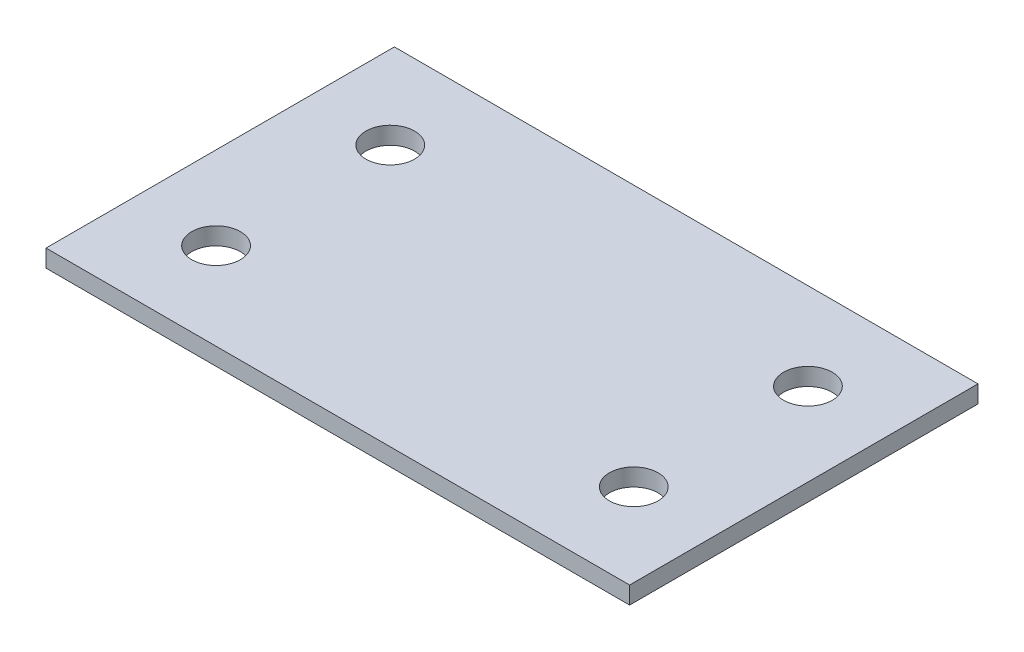
ISO-10303-21;
HEADER;
FILE_DESCRIPTION(('STEP AP214'),'2;1');
FILE_NAME('part.step','',(''),(''),'','','');
FILE_SCHEMA(('AUTOMOTIVE_DESIGN { 1 0 10303 214 1 1 1 1 }'));
ENDSEC;
DATA;
#1=APPLICATION_CONTEXT('core data for automotive mechanical design processes');
#2=APPLICATION_PROTOCOL_DEFINITION('international standard','automotive_design',2000,#1);
#3=PRODUCT_CONTEXT('',#1,'mechanical');
#4=PRODUCT('Part','Part','',(#3));
#5=PRODUCT_RELATED_PRODUCT_CATEGORY('part','',(#4));
#6=PRODUCT_DEFINITION_FORMATION('','',#4);
#7=PRODUCT_DEFINITION_CONTEXT('part definition',#1,'design');
#8=PRODUCT_DEFINITION('design','',#6,#7);
#9=PRODUCT_DEFINITION_SHAPE('','',#8);
#10=(LENGTH_UNIT() NAMED_UNIT(*) SI_UNIT(.MILLI.,.METRE.));
#11=(NAMED_UNIT(*) PLANE_ANGLE_UNIT() SI_UNIT($,.RADIAN.));
#12=(NAMED_UNIT(*) SI_UNIT($,.STERADIAN.) SOLID_ANGLE_UNIT());
#13=UNCERTAINTY_MEASURE_WITH_UNIT(LENGTH_MEASURE(1.E-05),#10,'distance_accuracy_value','');
#14=(GEOMETRIC_REPRESENTATION_CONTEXT(3) GLOBAL_UNCERTAINTY_ASSIGNED_CONTEXT((#13)) GLOBAL_UNIT_ASSIGNED_CONTEXT((#10,
#11,#12)) REPRESENTATION_CONTEXT('',''));
#15=CARTESIAN_POINT('',(0.,0.,0.));
#16=DIRECTION('',(0.,0.,1.));
#17=DIRECTION('',(1.,0.,0.));
#18=AXIS2_PLACEMENT_3D('',#15,#16,#17);
#19=CARTESIAN_POINT('',(2.596030114,0.,20.));
#20=DIRECTION('',(0.,1.,0.));
#21=DIRECTION('',(-1.,0.,0.));
#22=AXIS2_PLACEMENT_3D('',#19,#20,#21);
#23=PLANE('',#22);
#24=CARTESIAN_POINT('',(26.5751877305636,0.,4.999999967));
#25=DIRECTION('',(0.,1.,0.));
#26=DIRECTION('',(-1.,0.,0.));
#27=AXIS2_PLACEMENT_3D('',#24,#25,#26);
#28=CIRCLE('',#27,1.397);
#29=CARTESIAN_POINT('',(25.1781877305636,0.,4.999999967));
#30=VERTEX_POINT('',#29);
#31=EDGE_CURVE('E115',#30,#30,#28,.F.);
#32=ORIENTED_EDGE('',*,*,#31,.F.);
#33=EDGE_LOOP('',(#32));
#34=FACE_BOUND('',#33,.T.);
#35=CARTESIAN_POINT('',(2.596030114,0.,4.999999967));
#36=DIRECTION('',(0.,1.,0.));
#37=DIRECTION('',(-1.,0.,0.));
#38=AXIS2_PLACEMENT_3D('',#35,#36,#37);
#39=CIRCLE('',#38,1.397);
#40=CARTESIAN_POINT('',(1.199030114,0.,4.999999967));
#41=VERTEX_POINT('',#40);
#42=EDGE_CURVE('E108',#41,#41,#39,.F.);
#43=ORIENTED_EDGE('',*,*,#42,.F.);
#44=EDGE_LOOP('',(#43));
#45=FACE_BOUND('',#44,.T.);
#46=CARTESIAN_POINT('',(2.596030114,0.,15.000000033));
#47=DIRECTION('',(0.,1.,0.));
#48=DIRECTION('',(-1.,0.,0.));
#49=AXIS2_PLACEMENT_3D('',#46,#47,#48);
#50=CIRCLE('',#49,1.397);
#51=CARTESIAN_POINT('',(1.199030114,0.,15.000000033));
#52=VERTEX_POINT('',#51);
#53=EDGE_CURVE('E107',#52,#52,#50,.F.);
#54=ORIENTED_EDGE('',*,*,#53,.F.);
#55=EDGE_LOOP('',(#54));
#56=FACE_BOUND('',#55,.T.);
#57=CARTESIAN_POINT('',(26.5751877305636,0.,15.000000033));
#58=DIRECTION('',(0.,1.,0.));
#59=DIRECTION('',(-1.,0.,0.));
#60=AXIS2_PLACEMENT_3D('',#57,#58,#59);
#61=CIRCLE('',#60,1.397);
#62=CARTESIAN_POINT('',(25.1781877305636,0.,15.000000033));
#63=VERTEX_POINT('',#62);
#64=EDGE_CURVE('E124',#63,#63,#61,.F.);
#65=ORIENTED_EDGE('',*,*,#64,.F.);
#66=EDGE_LOOP('',(#65));
#67=FACE_BOUND('',#66,.T.);
#68=DIRECTION('',(1.,0.,0.));
#69=VECTOR('',#68,1.);
#70=CARTESIAN_POINT('',(2.596030114,0.,0.));
#71=LINE('',#70,#69);
#72=CARTESIAN_POINT('',(-2.16646989,0.,0.));
#73=VERTEX_POINT('',#72);
#74=CARTESIAN_POINT('',(31.3376877345636,0.,0.));
#75=VERTEX_POINT('',#74);
#76=EDGE_CURVE('E48',#73,#75,#71,.T.);
#77=ORIENTED_EDGE('',*,*,#76,.T.);
#78=DIRECTION('',(0.,0.,1.));
#79=VECTOR('',#78,1.);
#80=CARTESIAN_POINT('',(31.3376877345636,0.,0.));
#81=LINE('',#80,#79);
#82=CARTESIAN_POINT('',(31.3376877345636,0.,20.));
#83=VERTEX_POINT('',#82);
#84=EDGE_CURVE('E96',#75,#83,#81,.T.);
#85=ORIENTED_EDGE('',*,*,#84,.T.);
#86=DIRECTION('',(1.,0.,0.));
#87=VECTOR('',#86,1.);
#88=CARTESIAN_POINT('',(0.,0.,20.));
#89=LINE('',#88,#87);
#90=CARTESIAN_POINT('',(-2.16646989,0.,20.));
#91=VERTEX_POINT('',#90);
#92=EDGE_CURVE('E40',#91,#83,#89,.T.);
#93=ORIENTED_EDGE('',*,*,#92,.F.);
#94=DIRECTION('',(0.,0.,-1.));
#95=VECTOR('',#94,1.);
#96=CARTESIAN_POINT('',(-2.16646989,0.,0.));
#97=LINE('',#96,#95);
#98=EDGE_CURVE('E94',#91,#73,#97,.T.);
#99=ORIENTED_EDGE('',*,*,#98,.T.);
#100=EDGE_LOOP('',(#77,#85,#93,#99));
#101=FACE_BOUND('',#100,.T.);
#102=ADVANCED_FACE('F32',(#34,#45,#56,#67,#101),#23,.F.);
#103=CARTESIAN_POINT('',(26.5751877305636,1.,20.));
#104=DIRECTION('',(0.,-1.,0.));
#105=DIRECTION('',(1.,0.,0.));
#106=AXIS2_PLACEMENT_3D('',#103,#104,#105);
#107=PLANE('',#106);
#108=CARTESIAN_POINT('',(26.5751877305636,1.,4.999999967));
#109=DIRECTION('',(0.,1.,0.));
#110=DIRECTION('',(-1.,0.,0.));
#111=AXIS2_PLACEMENT_3D('',#108,#109,#110);
#112=CIRCLE('',#111,1.397);
#113=CARTESIAN_POINT('',(25.1781877305636,1.,4.999999967));
#114=VERTEX_POINT('',#113);
#115=EDGE_CURVE('E98',#114,#114,#112,.T.);
#116=ORIENTED_EDGE('',*,*,#115,.F.);
#117=EDGE_LOOP('',(#116));
#118=FACE_BOUND('',#117,.T.);
#119=CARTESIAN_POINT('',(2.596030114,1.,4.999999967));
#120=DIRECTION('',(0.,1.,0.));
#121=DIRECTION('',(-1.,0.,0.));
#122=AXIS2_PLACEMENT_3D('',#119,#120,#121);
#123=CIRCLE('',#122,1.397);
#124=CARTESIAN_POINT('',(1.199030114,1.,4.999999967));
#125=VERTEX_POINT('',#124);
#126=EDGE_CURVE('E112',#125,#125,#123,.T.);
#127=ORIENTED_EDGE('',*,*,#126,.F.);
#128=EDGE_LOOP('',(#127));
#129=FACE_BOUND('',#128,.T.);
#130=CARTESIAN_POINT('',(2.596030114,1.,15.000000033));
#131=DIRECTION('',(0.,1.,0.));
#132=DIRECTION('',(-1.,0.,0.));
#133=AXIS2_PLACEMENT_3D('',#130,#131,#132);
#134=CIRCLE('',#133,1.397);
#135=CARTESIAN_POINT('',(1.199030114,1.,15.000000033));
#136=VERTEX_POINT('',#135);
#137=EDGE_CURVE('E104',#136,#136,#134,.T.);
#138=ORIENTED_EDGE('',*,*,#137,.F.);
#139=EDGE_LOOP('',(#138));
#140=FACE_BOUND('',#139,.T.);
#141=CARTESIAN_POINT('',(26.5751877305636,1.,15.000000033));
#142=DIRECTION('',(0.,1.,0.));
#143=DIRECTION('',(-1.,0.,0.));
#144=AXIS2_PLACEMENT_3D('',#141,#142,#143);
#145=CIRCLE('',#144,1.397);
#146=CARTESIAN_POINT('',(25.1781877305636,1.,15.000000033));
#147=VERTEX_POINT('',#146);
#148=EDGE_CURVE('E111',#147,#147,#145,.T.);
#149=ORIENTED_EDGE('',*,*,#148,.F.);
#150=EDGE_LOOP('',(#149));
#151=FACE_BOUND('',#150,.T.);
#152=DIRECTION('',(-1.,0.,0.));
#153=VECTOR('',#152,1.);
#154=CARTESIAN_POINT('',(26.5751877305636,1.,0.));
#155=LINE('',#154,#153);
#156=CARTESIAN_POINT('',(31.3376877345636,1.00000000000001,0.));
#157=VERTEX_POINT('',#156);
#158=CARTESIAN_POINT('',(-2.16646989,1.,0.));
#159=VERTEX_POINT('',#158);
#160=EDGE_CURVE('E35',#157,#159,#155,.T.);
#161=ORIENTED_EDGE('',*,*,#160,.T.);
#162=DIRECTION('',(0.,0.,1.));
#163=VECTOR('',#162,1.);
#164=CARTESIAN_POINT('',(-2.16646989,1.,0.));
#165=LINE('',#164,#163);
#166=CARTESIAN_POINT('',(-2.16646989,1.,20.));
#167=VERTEX_POINT('',#166);
#168=EDGE_CURVE('E76',#159,#167,#165,.T.);
#169=ORIENTED_EDGE('',*,*,#168,.T.);
#170=DIRECTION('',(-1.,0.,0.));
#171=VECTOR('',#170,1.);
#172=CARTESIAN_POINT('',(29.1712178445636,1.,20.));
#173=LINE('',#172,#171);
#174=CARTESIAN_POINT('',(31.3376877345636,1.00000000000001,20.));
#175=VERTEX_POINT('',#174);
#176=EDGE_CURVE('E11',#175,#167,#173,.T.);
#177=ORIENTED_EDGE('',*,*,#176,.F.);
#178=DIRECTION('',(0.,0.,-1.));
#179=VECTOR('',#178,1.);
#180=CARTESIAN_POINT('',(31.3376877345636,1.00000000000001,0.));
#181=LINE('',#180,#179);
#182=EDGE_CURVE('E78',#175,#157,#181,.T.);
#183=ORIENTED_EDGE('',*,*,#182,.T.);
#184=EDGE_LOOP('',(#161,#169,#177,#183));
#185=FACE_BOUND('',#184,.T.);
#186=ADVANCED_FACE('F74',(#118,#129,#140,#151,#185),#107,.F.);
#187=CARTESIAN_POINT('',(0.,0.,20.));
#188=DIRECTION('',(0.,0.,1.));
#189=DIRECTION('',(1.,0.,0.));
#190=AXIS2_PLACEMENT_3D('',#187,#188,#189);
#191=PLANE('',#190);
#192=ORIENTED_EDGE('',*,*,#176,.T.);
#193=DIRECTION('',(0.,1.,0.));
#194=VECTOR('',#193,1.);
#195=CARTESIAN_POINT('',(-2.16646988999999,-20.1169975837419,20.));
#196=LINE('',#195,#194);
#197=EDGE_CURVE('E87',#91,#167,#196,.T.);
#198=ORIENTED_EDGE('',*,*,#197,.F.);
#199=ORIENTED_EDGE('',*,*,#92,.T.);
#200=DIRECTION('',(0.,1.,0.));
#201=VECTOR('',#200,1.);
#202=CARTESIAN_POINT('',(31.3376877345636,-20.1169975837419,20.));
#203=LINE('',#202,#201);
#204=EDGE_CURVE('E101',#83,#175,#203,.T.);
#205=ORIENTED_EDGE('',*,*,#204,.T.);
#206=EDGE_LOOP('',(#192,#198,#199,#205));
#207=FACE_BOUND('',#206,.T.);
#208=ADVANCED_FACE('F137',(#207),#191,.T.);
#209=CARTESIAN_POINT('',(0.,0.,0.));
#210=DIRECTION('',(0.,0.,1.));
#211=DIRECTION('',(1.,0.,0.));
#212=AXIS2_PLACEMENT_3D('',#209,#210,#211);
#213=PLANE('',#212);
#214=ORIENTED_EDGE('',*,*,#76,.F.);
#215=DIRECTION('',(0.,1.,0.));
#216=VECTOR('',#215,1.);
#217=CARTESIAN_POINT('',(-2.16646988999999,-20.1169975837419,0.));
#218=LINE('',#217,#216);
#219=EDGE_CURVE('E83',#73,#159,#218,.T.);
#220=ORIENTED_EDGE('',*,*,#219,.T.);
#221=ORIENTED_EDGE('',*,*,#160,.F.);
#222=DIRECTION('',(0.,1.,0.));
#223=VECTOR('',#222,1.);
#224=CARTESIAN_POINT('',(31.3376877345636,-20.1169975837419,0.));
#225=LINE('',#224,#223);
#226=EDGE_CURVE('E99',#75,#157,#225,.T.);
#227=ORIENTED_EDGE('',*,*,#226,.F.);
#228=EDGE_LOOP('',(#214,#220,#221,#227));
#229=FACE_BOUND('',#228,.T.);
#230=ADVANCED_FACE('F84',(#229),#213,.F.);
#231=CARTESIAN_POINT('',(26.5751877305636,-3.95131269327042,15.000000033));
#232=DIRECTION('',(0.,1.,0.));
#233=DIRECTION('',(-1.,0.,0.));
#234=AXIS2_PLACEMENT_3D('',#231,#232,#233);
#235=CYLINDRICAL_SURFACE('',#234,1.397);
#236=ORIENTED_EDGE('',*,*,#64,.T.);
#237=EDGE_LOOP('',(#236));
#238=FACE_BOUND('',#237,.T.);
#239=ORIENTED_EDGE('',*,*,#148,.T.);
#240=EDGE_LOOP('',(#239));
#241=FACE_BOUND('',#240,.T.);
#242=ADVANCED_FACE('F129',(#238,#241),#235,.F.);
#243=CARTESIAN_POINT('',(2.596030114,-3.95131269327043,15.000000033));
#244=DIRECTION('',(0.,1.,0.));
#245=DIRECTION('',(-1.,0.,0.));
#246=AXIS2_PLACEMENT_3D('',#243,#244,#245);
#247=CYLINDRICAL_SURFACE('',#246,1.397);
#248=ORIENTED_EDGE('',*,*,#53,.T.);
#249=EDGE_LOOP('',(#248));
#250=FACE_BOUND('',#249,.T.);
#251=ORIENTED_EDGE('',*,*,#137,.T.);
#252=EDGE_LOOP('',(#251));
#253=FACE_BOUND('',#252,.T.);
#254=ADVANCED_FACE('F145',(#250,#253),#247,.F.);
#255=CARTESIAN_POINT('',(2.596030114,-3.95131269327043,4.999999967));
#256=DIRECTION('',(0.,1.,0.));
#257=DIRECTION('',(-1.,0.,0.));
#258=AXIS2_PLACEMENT_3D('',#255,#256,#257);
#259=CYLINDRICAL_SURFACE('',#258,1.397);
#260=ORIENTED_EDGE('',*,*,#42,.T.);
#261=EDGE_LOOP('',(#260));
#262=FACE_BOUND('',#261,.T.);
#263=ORIENTED_EDGE('',*,*,#126,.T.);
#264=EDGE_LOOP('',(#263));
#265=FACE_BOUND('',#264,.T.);
#266=ADVANCED_FACE('F148',(#262,#265),#259,.F.);
#267=CARTESIAN_POINT('',(26.5751877305636,-3.95131269327042,4.999999967));
#268=DIRECTION('',(0.,1.,0.));
#269=DIRECTION('',(-1.,0.,0.));
#270=AXIS2_PLACEMENT_3D('',#267,#268,#269);
#271=CYLINDRICAL_SURFACE('',#270,1.397);
#272=ORIENTED_EDGE('',*,*,#31,.T.);
#273=EDGE_LOOP('',(#272));
#274=FACE_BOUND('',#273,.T.);
#275=ORIENTED_EDGE('',*,*,#115,.T.);
#276=EDGE_LOOP('',(#275));
#277=FACE_BOUND('',#276,.T.);
#278=ADVANCED_FACE('F162',(#274,#277),#271,.F.);
#279=CARTESIAN_POINT('',(31.3376877345636,-20.1169975837419,0.));
#280=DIRECTION('',(1.,0.,0.));
#281=DIRECTION('',(0.,1.,0.));
#282=AXIS2_PLACEMENT_3D('',#279,#280,#281);
#283=PLANE('',#282);
#284=ORIENTED_EDGE('',*,*,#84,.F.);
#285=ORIENTED_EDGE('',*,*,#226,.T.);
#286=ORIENTED_EDGE('',*,*,#182,.F.);
#287=ORIENTED_EDGE('',*,*,#204,.F.);
#288=EDGE_LOOP('',(#284,#285,#286,#287));
#289=FACE_BOUND('',#288,.T.);
#290=ADVANCED_FACE('F169',(#289),#283,.T.);
#291=CARTESIAN_POINT('',(-2.16646988999999,-20.1169975837419,0.));
#292=DIRECTION('',(-1.,0.,0.));
#293=DIRECTION('',(0.,-1.,0.));
#294=AXIS2_PLACEMENT_3D('',#291,#292,#293);
#295=PLANE('',#294);
#296=ORIENTED_EDGE('',*,*,#98,.F.);
#297=ORIENTED_EDGE('',*,*,#197,.T.);
#298=ORIENTED_EDGE('',*,*,#168,.F.);
#299=ORIENTED_EDGE('',*,*,#219,.F.);
#300=EDGE_LOOP('',(#296,#297,#298,#299));
#301=FACE_BOUND('',#300,.T.);
#302=ADVANCED_FACE('F90',(#301),#295,.T.);
#303=CLOSED_SHELL('',(#102,#186,#208,#230,#242,#254,#266,#278,#290,#302));
#304=MANIFOLD_SOLID_BREP('B2',#303);
#305=ADVANCED_BREP_SHAPE_REPRESENTATION('',(#18,#304),#14);
#306=SHAPE_DEFINITION_REPRESENTATION(#9,#305);
ENDSEC;
END-ISO-10303-21;
